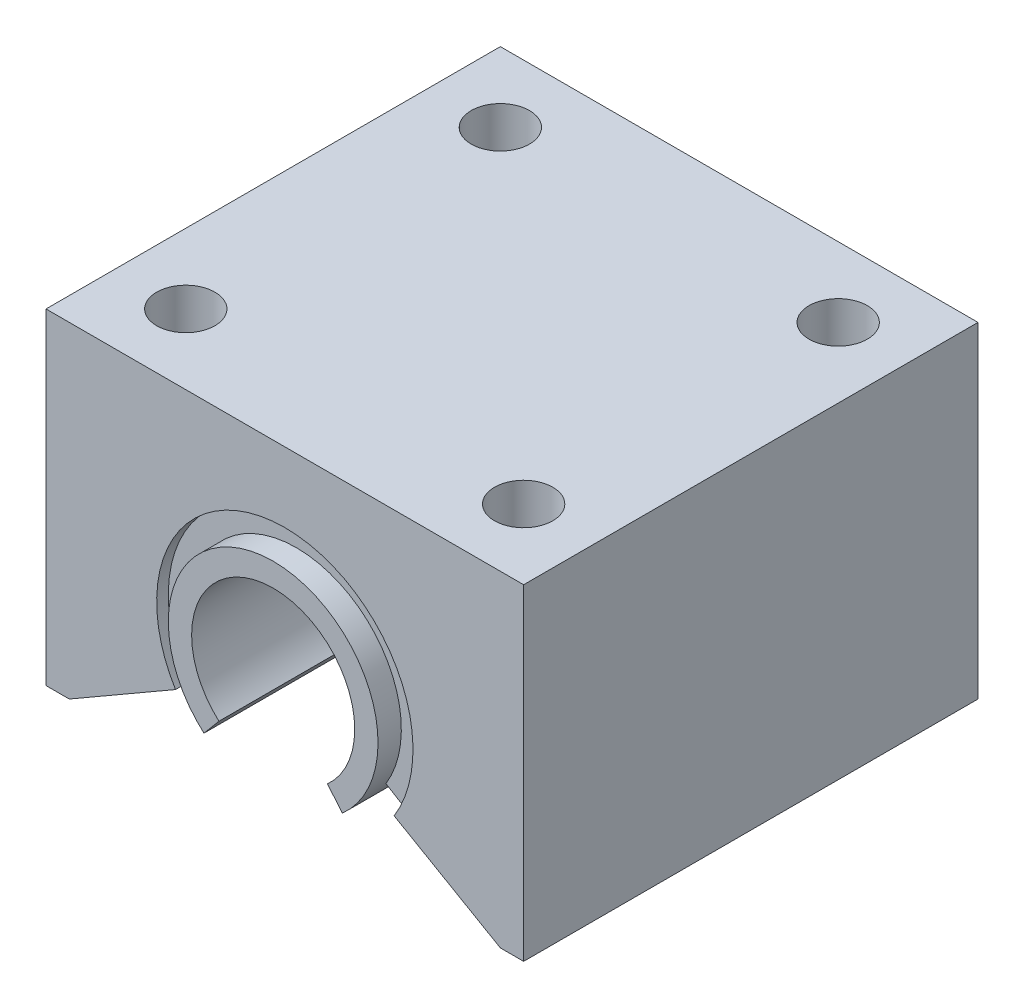
ISO-10303-21;
HEADER;
FILE_DESCRIPTION(('STEP AP214'),'2;1');
FILE_NAME('part.step','',(''),(''),'','','');
FILE_SCHEMA(('AUTOMOTIVE_DESIGN { 1 0 10303 214 1 1 1 1 }'));
ENDSEC;
DATA;
#1=APPLICATION_CONTEXT('core data for automotive mechanical design processes');
#2=APPLICATION_PROTOCOL_DEFINITION('international standard','automotive_design',2000,#1);
#3=PRODUCT_CONTEXT('',#1,'mechanical');
#4=PRODUCT('Part','Part','',(#3));
#5=PRODUCT_RELATED_PRODUCT_CATEGORY('part','',(#4));
#6=PRODUCT_DEFINITION_FORMATION('','',#4);
#7=PRODUCT_DEFINITION_CONTEXT('part definition',#1,'design');
#8=PRODUCT_DEFINITION('design','',#6,#7);
#9=PRODUCT_DEFINITION_SHAPE('','',#8);
#10=(LENGTH_UNIT() NAMED_UNIT(*) SI_UNIT(.MILLI.,.METRE.));
#11=(NAMED_UNIT(*) PLANE_ANGLE_UNIT() SI_UNIT($,.RADIAN.));
#12=(NAMED_UNIT(*) SI_UNIT($,.STERADIAN.) SOLID_ANGLE_UNIT());
#13=UNCERTAINTY_MEASURE_WITH_UNIT(LENGTH_MEASURE(1.E-05),#10,'distance_accuracy_value','');
#14=(GEOMETRIC_REPRESENTATION_CONTEXT(3) GLOBAL_UNCERTAINTY_ASSIGNED_CONTEXT((#13)) GLOBAL_UNIT_ASSIGNED_CONTEXT((#10,
#11,#12)) REPRESENTATION_CONTEXT('',''));
#15=CARTESIAN_POINT('',(0.,0.,0.));
#16=DIRECTION('',(0.,0.,1.));
#17=DIRECTION('',(1.,0.,0.));
#18=AXIS2_PLACEMENT_3D('',#15,#16,#17);
#19=CARTESIAN_POINT('',(0.,-3.,39.));
#20=DIRECTION('',(0.,0.,-1.));
#21=DIRECTION('',(-1.,0.,0.));
#22=AXIS2_PLACEMENT_3D('',#19,#20,#21);
#23=CYLINDRICAL_SURFACE('',#22,11.);
#24=CARTESIAN_POINT('',(0.,-3.,1.));
#25=DIRECTION('',(0.,0.,1.));
#26=DIRECTION('',(1.,0.,0.));
#27=AXIS2_PLACEMENT_3D('',#24,#25,#26);
#28=CIRCLE('',#27,11.);
#29=CARTESIAN_POINT('',(9.38513451930909,-8.73752996109588,1.));
#30=VERTEX_POINT('',#29);
#31=CARTESIAN_POINT('',(-9.38513451930909,-8.73752996109588,1.));
#32=VERTEX_POINT('',#31);
#33=EDGE_CURVE('E56',#30,#32,#28,.T.);
#34=ORIENTED_EDGE('',*,*,#33,.T.);
#35=DIRECTION('',(0.,0.,-1.));
#36=VECTOR('',#35,1.);
#37=CARTESIAN_POINT('',(-9.38513451930909,-8.73752996109588,39.));
#38=LINE('',#37,#36);
#39=CARTESIAN_POINT('',(-9.38513451930909,-8.73752996109588,0.));
#40=VERTEX_POINT('',#39);
#41=EDGE_CURVE('E145',#32,#40,#38,.T.);
#42=ORIENTED_EDGE('',*,*,#41,.T.);
#43=CARTESIAN_POINT('',(0.,-3.,0.));
#44=DIRECTION('',(0.,0.,-1.));
#45=DIRECTION('',(1.,0.,0.));
#46=AXIS2_PLACEMENT_3D('',#43,#44,#45);
#47=CIRCLE('',#46,11.);
#48=CARTESIAN_POINT('',(9.38513451930909,-8.73752996109588,0.));
#49=VERTEX_POINT('',#48);
#50=EDGE_CURVE('E168',#40,#49,#47,.T.);
#51=ORIENTED_EDGE('',*,*,#50,.T.);
#52=DIRECTION('',(0.,0.,-1.));
#53=VECTOR('',#52,1.);
#54=CARTESIAN_POINT('',(9.38513451930909,-8.73752996109588,39.));
#55=LINE('',#54,#53);
#56=EDGE_CURVE('E174',#30,#49,#55,.T.);
#57=ORIENTED_EDGE('',*,*,#56,.F.);
#58=EDGE_LOOP('',(#34,#42,#51,#57));
#59=FACE_BOUND('',#58,.T.);
#60=ADVANCED_FACE('F41',(#59),#23,.F.);
#61=CARTESIAN_POINT('',(18.5,-14.,39.));
#62=DIRECTION('',(0.,1.,0.));
#63=DIRECTION('',(-1.,0.,0.));
#64=AXIS2_PLACEMENT_3D('',#61,#62,#63);
#65=PLANE('',#64);
#66=DIRECTION('',(1.,0.,0.));
#67=VECTOR('',#66,1.);
#68=CARTESIAN_POINT('',(18.5,-14.,0.));
#69=LINE('',#68,#67);
#70=CARTESIAN_POINT('',(18.5,-14.,0.));
#71=VERTEX_POINT('',#70);
#72=CARTESIAN_POINT('',(20.5,-14.,0.));
#73=VERTEX_POINT('',#72);
#74=EDGE_CURVE('E155',#71,#73,#69,.T.);
#75=ORIENTED_EDGE('',*,*,#74,.T.);
#76=DIRECTION('',(0.,0.,-1.));
#77=VECTOR('',#76,1.);
#78=CARTESIAN_POINT('',(20.5,-14.,39.));
#79=LINE('',#78,#77);
#80=CARTESIAN_POINT('',(20.5,-14.,39.));
#81=VERTEX_POINT('',#80);
#82=EDGE_CURVE('E11',#81,#73,#79,.T.);
#83=ORIENTED_EDGE('',*,*,#82,.F.);
#84=DIRECTION('',(1.,0.,0.));
#85=VECTOR('',#84,1.);
#86=CARTESIAN_POINT('',(18.5,-14.,39.));
#87=LINE('',#86,#85);
#88=CARTESIAN_POINT('',(18.5,-14.,39.));
#89=VERTEX_POINT('',#88);
#90=EDGE_CURVE('E172',#89,#81,#87,.T.);
#91=ORIENTED_EDGE('',*,*,#90,.F.);
#92=DIRECTION('',(0.,0.,-1.));
#93=VECTOR('',#92,1.);
#94=CARTESIAN_POINT('',(18.5,-14.,39.));
#95=LINE('',#94,#93);
#96=EDGE_CURVE('E151',#89,#71,#95,.T.);
#97=ORIENTED_EDGE('',*,*,#96,.T.);
#98=EDGE_LOOP('',(#75,#83,#91,#97));
#99=FACE_BOUND('',#98,.T.);
#100=ADVANCED_FACE('F43',(#99),#65,.F.);
#101=CARTESIAN_POINT('',(20.5,14.,39.));
#102=DIRECTION('',(-1.,0.,0.));
#103=DIRECTION('',(0.,-1.,0.));
#104=AXIS2_PLACEMENT_3D('',#101,#102,#103);
#105=PLANE('',#104);
#106=DIRECTION('',(0.,1.,0.));
#107=VECTOR('',#106,1.);
#108=CARTESIAN_POINT('',(20.5,14.,0.));
#109=LINE('',#108,#107);
#110=CARTESIAN_POINT('',(20.5,14.,0.));
#111=VERTEX_POINT('',#110);
#112=EDGE_CURVE('E158',#73,#111,#109,.T.);
#113=ORIENTED_EDGE('',*,*,#112,.T.);
#114=DIRECTION('',(0.,0.,-1.));
#115=VECTOR('',#114,1.);
#116=CARTESIAN_POINT('',(20.5,14.,39.));
#117=LINE('',#116,#115);
#118=CARTESIAN_POINT('',(20.5,14.,39.));
#119=VERTEX_POINT('',#118);
#120=EDGE_CURVE('E49',#119,#111,#117,.T.);
#121=ORIENTED_EDGE('',*,*,#120,.F.);
#122=DIRECTION('',(0.,1.,0.));
#123=VECTOR('',#122,1.);
#124=CARTESIAN_POINT('',(20.5,14.,39.));
#125=LINE('',#124,#123);
#126=EDGE_CURVE('E105',#81,#119,#125,.T.);
#127=ORIENTED_EDGE('',*,*,#126,.F.);
#128=ORIENTED_EDGE('',*,*,#82,.T.);
#129=EDGE_LOOP('',(#113,#121,#127,#128));
#130=FACE_BOUND('',#129,.T.);
#131=ADVANCED_FACE('F353',(#130),#105,.F.);
#132=CARTESIAN_POINT('',(-20.5,14.,39.));
#133=DIRECTION('',(0.,-1.,0.));
#134=DIRECTION('',(0.,0.,-1.));
#135=AXIS2_PLACEMENT_3D('',#132,#133,#134);
#136=PLANE('',#135);
#137=CARTESIAN_POINT('',(-14.4999987013249,14.,33.));
#138=DIRECTION('',(0.,1.,0.));
#139=DIRECTION('',(0.,0.,1.));
#140=AXIS2_PLACEMENT_3D('',#137,#138,#139);
#141=CIRCLE('',#140,2.5);
#142=CARTESIAN_POINT('',(-14.4999987013249,14.,35.5));
#143=VERTEX_POINT('',#142);
#144=EDGE_CURVE('E281',#143,#143,#141,.T.);
#145=ORIENTED_EDGE('',*,*,#144,.F.);
#146=EDGE_LOOP('',(#145));
#147=FACE_BOUND('',#146,.T.);
#148=CARTESIAN_POINT('',(14.5,14.,33.));
#149=DIRECTION('',(0.,1.,0.));
#150=DIRECTION('',(0.,0.,1.));
#151=AXIS2_PLACEMENT_3D('',#148,#149,#150);
#152=CIRCLE('',#151,2.5);
#153=CARTESIAN_POINT('',(14.5,14.,35.5));
#154=VERTEX_POINT('',#153);
#155=EDGE_CURVE('E288',#154,#154,#152,.T.);
#156=ORIENTED_EDGE('',*,*,#155,.F.);
#157=EDGE_LOOP('',(#156));
#158=FACE_BOUND('',#157,.T.);
#159=CARTESIAN_POINT('',(14.4999987013249,14.,6.));
#160=DIRECTION('',(0.,1.,0.));
#161=DIRECTION('',(0.,0.,1.));
#162=AXIS2_PLACEMENT_3D('',#159,#160,#161);
#163=CIRCLE('',#162,2.5);
#164=CARTESIAN_POINT('',(14.4999987013249,14.,8.5));
#165=VERTEX_POINT('',#164);
#166=EDGE_CURVE('E294',#165,#165,#163,.T.);
#167=ORIENTED_EDGE('',*,*,#166,.F.);
#168=EDGE_LOOP('',(#167));
#169=FACE_BOUND('',#168,.T.);
#170=CARTESIAN_POINT('',(-14.5,14.,6.));
#171=DIRECTION('',(0.,1.,0.));
#172=DIRECTION('',(0.,0.,1.));
#173=AXIS2_PLACEMENT_3D('',#170,#171,#172);
#174=CIRCLE('',#173,2.5);
#175=CARTESIAN_POINT('',(-14.5,14.,8.5));
#176=VERTEX_POINT('',#175);
#177=EDGE_CURVE('E275',#176,#176,#174,.T.);
#178=ORIENTED_EDGE('',*,*,#177,.F.);
#179=EDGE_LOOP('',(#178));
#180=FACE_BOUND('',#179,.T.);
#181=DIRECTION('',(-1.,0.,0.));
#182=VECTOR('',#181,1.);
#183=CARTESIAN_POINT('',(-20.5,14.,0.));
#184=LINE('',#183,#182);
#185=CARTESIAN_POINT('',(-20.5,14.,0.));
#186=VERTEX_POINT('',#185);
#187=EDGE_CURVE('E160',#111,#186,#184,.T.);
#188=ORIENTED_EDGE('',*,*,#187,.T.);
#189=DIRECTION('',(0.,0.,-1.));
#190=VECTOR('',#189,1.);
#191=CARTESIAN_POINT('',(-20.5,14.,39.));
#192=LINE('',#191,#190);
#193=CARTESIAN_POINT('',(-20.5,14.,39.));
#194=VERTEX_POINT('',#193);
#195=EDGE_CURVE('E180',#194,#186,#192,.T.);
#196=ORIENTED_EDGE('',*,*,#195,.F.);
#197=DIRECTION('',(-1.,0.,0.));
#198=VECTOR('',#197,1.);
#199=CARTESIAN_POINT('',(-20.5,14.,39.));
#200=LINE('',#199,#198);
#201=EDGE_CURVE('E188',#119,#194,#200,.T.);
#202=ORIENTED_EDGE('',*,*,#201,.F.);
#203=ORIENTED_EDGE('',*,*,#120,.T.);
#204=EDGE_LOOP('',(#188,#196,#202,#203));
#205=FACE_BOUND('',#204,.T.);
#206=ADVANCED_FACE('F186',(#147,#158,#169,#180,#205),#136,.F.);
#207=CARTESIAN_POINT('',(-20.5,14.,39.));
#208=DIRECTION('',(1.,0.,0.));
#209=DIRECTION('',(0.,1.,0.));
#210=AXIS2_PLACEMENT_3D('',#207,#208,#209);
#211=PLANE('',#210);
#212=DIRECTION('',(0.,-1.,0.));
#213=VECTOR('',#212,1.);
#214=CARTESIAN_POINT('',(-20.5,14.,0.));
#215=LINE('',#214,#213);
#216=CARTESIAN_POINT('',(-20.5,-14.,0.));
#217=VERTEX_POINT('',#216);
#218=EDGE_CURVE('E162',#186,#217,#215,.T.);
#219=ORIENTED_EDGE('',*,*,#218,.T.);
#220=DIRECTION('',(0.,0.,-1.));
#221=VECTOR('',#220,1.);
#222=CARTESIAN_POINT('',(-20.5,-14.,39.));
#223=LINE('',#222,#221);
#224=CARTESIAN_POINT('',(-20.5,-14.,39.));
#225=VERTEX_POINT('',#224);
#226=EDGE_CURVE('E177',#225,#217,#223,.T.);
#227=ORIENTED_EDGE('',*,*,#226,.F.);
#228=DIRECTION('',(0.,-1.,0.));
#229=VECTOR('',#228,1.);
#230=CARTESIAN_POINT('',(-20.5,14.,39.));
#231=LINE('',#230,#229);
#232=EDGE_CURVE('E201',#194,#225,#231,.T.);
#233=ORIENTED_EDGE('',*,*,#232,.F.);
#234=ORIENTED_EDGE('',*,*,#195,.T.);
#235=EDGE_LOOP('',(#219,#227,#233,#234));
#236=FACE_BOUND('',#235,.T.);
#237=ADVANCED_FACE('F197',(#236),#211,.F.);
#238=CARTESIAN_POINT('',(-20.5,-14.,39.));
#239=DIRECTION('',(0.,1.,0.));
#240=DIRECTION('',(-1.,0.,0.));
#241=AXIS2_PLACEMENT_3D('',#238,#239,#240);
#242=PLANE('',#241);
#243=DIRECTION('',(1.,0.,0.));
#244=VECTOR('',#243,1.);
#245=CARTESIAN_POINT('',(-20.5,-14.,0.));
#246=LINE('',#245,#244);
#247=CARTESIAN_POINT('',(-18.5,-14.,0.));
#248=VERTEX_POINT('',#247);
#249=EDGE_CURVE('E164',#217,#248,#246,.T.);
#250=ORIENTED_EDGE('',*,*,#249,.T.);
#251=DIRECTION('',(0.,0.,-1.));
#252=VECTOR('',#251,1.);
#253=CARTESIAN_POINT('',(-18.5,-14.,39.));
#254=LINE('',#253,#252);
#255=CARTESIAN_POINT('',(-18.5,-14.,39.));
#256=VERTEX_POINT('',#255);
#257=EDGE_CURVE('E144',#256,#248,#254,.T.);
#258=ORIENTED_EDGE('',*,*,#257,.F.);
#259=DIRECTION('',(1.,0.,0.));
#260=VECTOR('',#259,1.);
#261=CARTESIAN_POINT('',(-20.5,-14.,39.));
#262=LINE('',#261,#260);
#263=EDGE_CURVE('E128',#225,#256,#262,.T.);
#264=ORIENTED_EDGE('',*,*,#263,.F.);
#265=ORIENTED_EDGE('',*,*,#226,.T.);
#266=EDGE_LOOP('',(#250,#258,#264,#265));
#267=FACE_BOUND('',#266,.T.);
#268=ADVANCED_FACE('F200',(#267),#242,.F.);
#269=CARTESIAN_POINT('',(-18.5,-14.,39.));
#270=DIRECTION('',(-0.5,0.866025403784439,0.));
#271=DIRECTION('',(-0.866025403784439,-0.5,0.));
#272=AXIS2_PLACEMENT_3D('',#269,#270,#271);
#273=PLANE('',#272);
#274=DIRECTION('',(0.866025403784439,0.5,0.));
#275=VECTOR('',#274,1.);
#276=CARTESIAN_POINT('',(-18.5,-14.,0.));
#277=LINE('',#276,#275);
#278=EDGE_CURVE('E166',#248,#40,#277,.T.);
#279=ORIENTED_EDGE('',*,*,#278,.T.);
#280=ORIENTED_EDGE('',*,*,#41,.F.);
#281=DIRECTION('',(0.,0.,-1.));
#282=VECTOR('',#281,1.);
#283=CARTESIAN_POINT('',(-9.38513451930909,-8.73752996109588,38.));
#284=LINE('',#283,#282);
#285=CARTESIAN_POINT('',(-9.38513451930909,-8.73752996109588,38.));
#286=VERTEX_POINT('',#285);
#287=EDGE_CURVE('E141',#286,#32,#284,.T.);
#288=ORIENTED_EDGE('',*,*,#287,.F.);
#289=CARTESIAN_POINT('',(-9.38513451930909,-8.73752996109588,39.));
#290=VERTEX_POINT('',#289);
#291=EDGE_CURVE('E135',#290,#286,#38,.T.);
#292=ORIENTED_EDGE('',*,*,#291,.F.);
#293=DIRECTION('',(0.866025403784439,0.5,0.));
#294=VECTOR('',#293,1.);
#295=CARTESIAN_POINT('',(-18.5,-14.,39.));
#296=LINE('',#295,#294);
#297=EDGE_CURVE('E121',#256,#290,#296,.T.);
#298=ORIENTED_EDGE('',*,*,#297,.F.);
#299=ORIENTED_EDGE('',*,*,#257,.T.);
#300=EDGE_LOOP('',(#279,#280,#288,#292,#298,#299));
#301=FACE_BOUND('',#300,.T.);
#302=ADVANCED_FACE('F137',(#301),#273,.F.);
#303=ORIENTED_EDGE('',*,*,#291,.T.);
#304=CARTESIAN_POINT('',(0.,-3.,38.));
#305=DIRECTION('',(0.,0.,1.));
#306=DIRECTION('',(1.,0.,0.));
#307=AXIS2_PLACEMENT_3D('',#304,#305,#306);
#308=CIRCLE('',#307,11.);
#309=CARTESIAN_POINT('',(9.38513451930905,-8.73752996109594,38.));
#310=VERTEX_POINT('',#309);
#311=EDGE_CURVE('E220',#310,#286,#308,.T.);
#312=ORIENTED_EDGE('',*,*,#311,.F.);
#313=CARTESIAN_POINT('',(9.38513451930909,-8.73752996109588,39.));
#314=VERTEX_POINT('',#313);
#315=EDGE_CURVE('E149',#314,#310,#55,.T.);
#316=ORIENTED_EDGE('',*,*,#315,.F.);
#317=CARTESIAN_POINT('',(0.,-3.,39.));
#318=DIRECTION('',(0.,0.,-1.));
#319=DIRECTION('',(1.,0.,0.));
#320=AXIS2_PLACEMENT_3D('',#317,#318,#319);
#321=CIRCLE('',#320,11.);
#322=EDGE_CURVE('E125',#290,#314,#321,.T.);
#323=ORIENTED_EDGE('',*,*,#322,.F.);
#324=EDGE_LOOP('',(#303,#312,#316,#323));
#325=FACE_BOUND('',#324,.T.);
#326=ADVANCED_FACE('F147',(#325),#23,.F.);
#327=CARTESIAN_POINT('',(18.5,-14.,39.));
#328=DIRECTION('',(0.500000000000001,0.866025403784438,0.));
#329=DIRECTION('',(-0.866025403784438,0.500000000000001,0.));
#330=AXIS2_PLACEMENT_3D('',#327,#328,#329);
#331=PLANE('',#330);
#332=DIRECTION('',(0.866025403784438,-0.500000000000001,0.));
#333=VECTOR('',#332,1.);
#334=CARTESIAN_POINT('',(18.5,-14.,0.));
#335=LINE('',#334,#333);
#336=EDGE_CURVE('E97',#49,#71,#335,.T.);
#337=ORIENTED_EDGE('',*,*,#336,.T.);
#338=ORIENTED_EDGE('',*,*,#96,.F.);
#339=DIRECTION('',(0.866025403784438,-0.500000000000001,0.));
#340=VECTOR('',#339,1.);
#341=CARTESIAN_POINT('',(18.5,-14.,39.));
#342=LINE('',#341,#340);
#343=EDGE_CURVE('E65',#314,#89,#342,.T.);
#344=ORIENTED_EDGE('',*,*,#343,.F.);
#345=ORIENTED_EDGE('',*,*,#315,.T.);
#346=DIRECTION('',(0.,0.,-1.));
#347=VECTOR('',#346,1.);
#348=CARTESIAN_POINT('',(9.38513451930905,-8.73752996109594,38.));
#349=LINE('',#348,#347);
#350=EDGE_CURVE('E214',#310,#30,#349,.T.);
#351=ORIENTED_EDGE('',*,*,#350,.T.);
#352=ORIENTED_EDGE('',*,*,#56,.T.);
#353=EDGE_LOOP('',(#337,#338,#344,#345,#351,#352));
#354=FACE_BOUND('',#353,.T.);
#355=ADVANCED_FACE('F392',(#354),#331,.F.);
#356=CARTESIAN_POINT('',(0.,-3.,39.));
#357=DIRECTION('',(0.,0.,1.));
#358=DIRECTION('',(1.,0.,0.));
#359=AXIS2_PLACEMENT_3D('',#356,#357,#358);
#360=PLANE('',#359);
#361=ORIENTED_EDGE('',*,*,#90,.T.);
#362=ORIENTED_EDGE('',*,*,#126,.T.);
#363=ORIENTED_EDGE('',*,*,#201,.T.);
#364=ORIENTED_EDGE('',*,*,#232,.T.);
#365=ORIENTED_EDGE('',*,*,#263,.T.);
#366=ORIENTED_EDGE('',*,*,#297,.T.);
#367=ORIENTED_EDGE('',*,*,#322,.T.);
#368=ORIENTED_EDGE('',*,*,#343,.T.);
#369=EDGE_LOOP('',(#361,#362,#363,#364,#365,#366,#367,#368));
#370=FACE_BOUND('',#369,.T.);
#371=ADVANCED_FACE('F123',(#370),#360,.T.);
#372=CARTESIAN_POINT('',(0.,-3.,0.));
#373=DIRECTION('',(0.,0.,1.));
#374=DIRECTION('',(1.,0.,0.));
#375=AXIS2_PLACEMENT_3D('',#372,#373,#374);
#376=PLANE('',#375);
#377=ORIENTED_EDGE('',*,*,#74,.F.);
#378=ORIENTED_EDGE('',*,*,#336,.F.);
#379=ORIENTED_EDGE('',*,*,#50,.F.);
#380=ORIENTED_EDGE('',*,*,#278,.F.);
#381=ORIENTED_EDGE('',*,*,#249,.F.);
#382=ORIENTED_EDGE('',*,*,#218,.F.);
#383=ORIENTED_EDGE('',*,*,#187,.F.);
#384=ORIENTED_EDGE('',*,*,#112,.F.);
#385=EDGE_LOOP('',(#377,#378,#379,#380,#381,#382,#383,#384));
#386=FACE_BOUND('',#385,.T.);
#387=ADVANCED_FACE('F192',(#386),#376,.F.);
#388=CARTESIAN_POINT('',(-9.38513451930909,-8.73752996109588,38.));
#389=DIRECTION('',(-0.521593632826898,0.853194047209918,0.));
#390=DIRECTION('',(-0.853194047209918,-0.521593632826898,0.));
#391=AXIS2_PLACEMENT_3D('',#388,#389,#390);
#392=PLANE('',#391);
#393=DIRECTION('',(0.853194047209918,0.521593632826898,0.));
#394=VECTOR('',#393,1.);
#395=CARTESIAN_POINT('',(-9.38513451930909,-8.73752996109588,1.));
#396=LINE('',#395,#394);
#397=CARTESIAN_POINT('',(-7.67874642488926,-7.69434269544209,1.));
#398=VERTEX_POINT('',#397);
#399=EDGE_CURVE('E224',#32,#398,#396,.T.);
#400=ORIENTED_EDGE('',*,*,#399,.T.);
#401=DIRECTION('',(0.,0.,-1.));
#402=VECTOR('',#401,1.);
#403=CARTESIAN_POINT('',(-7.67874642488926,-7.69434269544209,38.));
#404=LINE('',#403,#402);
#405=CARTESIAN_POINT('',(-7.67874642488926,-7.69434269544209,38.));
#406=VERTEX_POINT('',#405);
#407=EDGE_CURVE('E208',#406,#398,#404,.T.);
#408=ORIENTED_EDGE('',*,*,#407,.F.);
#409=DIRECTION('',(0.853194047209918,0.521593632826898,0.));
#410=VECTOR('',#409,1.);
#411=CARTESIAN_POINT('',(-9.38513451930909,-8.73752996109588,38.));
#412=LINE('',#411,#410);
#413=EDGE_CURVE('E234',#286,#406,#412,.T.);
#414=ORIENTED_EDGE('',*,*,#413,.F.);
#415=ORIENTED_EDGE('',*,*,#287,.T.);
#416=EDGE_LOOP('',(#400,#408,#414,#415));
#417=FACE_BOUND('',#416,.T.);
#418=ADVANCED_FACE('F697',(#417),#392,.F.);
#419=CARTESIAN_POINT('',(9.38513451930905,-8.73752996109594,38.));
#420=DIRECTION('',(0.521593632826904,0.853194047209914,0.));
#421=DIRECTION('',(-0.853194047209914,0.521593632826904,0.));
#422=AXIS2_PLACEMENT_3D('',#419,#420,#421);
#423=PLANE('',#422);
#424=DIRECTION('',(0.853194047209914,-0.521593632826904,0.));
#425=VECTOR('',#424,1.);
#426=CARTESIAN_POINT('',(9.38513451930905,-8.73752996109594,1.));
#427=LINE('',#426,#425);
#428=CARTESIAN_POINT('',(7.67874642488923,-7.69434269544213,1.));
#429=VERTEX_POINT('',#428);
#430=EDGE_CURVE('E218',#429,#30,#427,.T.);
#431=ORIENTED_EDGE('',*,*,#430,.T.);
#432=ORIENTED_EDGE('',*,*,#350,.F.);
#433=DIRECTION('',(0.853194047209914,-0.521593632826904,0.));
#434=VECTOR('',#433,1.);
#435=CARTESIAN_POINT('',(9.38513451930905,-8.73752996109594,38.));
#436=LINE('',#435,#434);
#437=CARTESIAN_POINT('',(7.67874642488922,-7.69434269544213,38.));
#438=VERTEX_POINT('',#437);
#439=EDGE_CURVE('E217',#438,#310,#436,.T.);
#440=ORIENTED_EDGE('',*,*,#439,.F.);
#441=DIRECTION('',(0.,0.,-1.));
#442=VECTOR('',#441,1.);
#443=CARTESIAN_POINT('',(7.67874642488922,-7.69434269544213,38.));
#444=LINE('',#443,#442);
#445=EDGE_CURVE('E211',#438,#429,#444,.T.);
#446=ORIENTED_EDGE('',*,*,#445,.T.);
#447=EDGE_LOOP('',(#431,#432,#440,#446));
#448=FACE_BOUND('',#447,.T.);
#449=ADVANCED_FACE('F689',(#448),#423,.F.);
#450=CARTESIAN_POINT('',(0.,-3.,38.));
#451=DIRECTION('',(0.,0.,1.));
#452=DIRECTION('',(1.,0.,0.));
#453=AXIS2_PLACEMENT_3D('',#450,#451,#452);
#454=PLANE('',#453);
#455=ORIENTED_EDGE('',*,*,#311,.T.);
#456=ORIENTED_EDGE('',*,*,#413,.T.);
#457=CARTESIAN_POINT('',(0.,-3.,38.));
#458=DIRECTION('',(0.,0.,-1.));
#459=DIRECTION('',(1.,0.,0.));
#460=AXIS2_PLACEMENT_3D('',#457,#458,#459);
#461=CIRCLE('',#460,9.);
#462=EDGE_CURVE('E231',#406,#438,#461,.T.);
#463=ORIENTED_EDGE('',*,*,#462,.T.);
#464=ORIENTED_EDGE('',*,*,#439,.T.);
#465=EDGE_LOOP('',(#455,#456,#463,#464));
#466=FACE_BOUND('',#465,.T.);
#467=ADVANCED_FACE('F682',(#466),#454,.T.);
#468=CARTESIAN_POINT('',(0.,-3.,1.));
#469=DIRECTION('',(0.,0.,1.));
#470=DIRECTION('',(1.,0.,0.));
#471=AXIS2_PLACEMENT_3D('',#468,#469,#470);
#472=PLANE('',#471);
#473=ORIENTED_EDGE('',*,*,#33,.F.);
#474=ORIENTED_EDGE('',*,*,#430,.F.);
#475=CARTESIAN_POINT('',(0.,-3.,1.));
#476=DIRECTION('',(0.,0.,-1.));
#477=DIRECTION('',(1.,0.,0.));
#478=AXIS2_PLACEMENT_3D('',#475,#476,#477);
#479=CIRCLE('',#478,9.);
#480=EDGE_CURVE('E221',#398,#429,#479,.T.);
#481=ORIENTED_EDGE('',*,*,#480,.F.);
#482=ORIENTED_EDGE('',*,*,#399,.F.);
#483=EDGE_LOOP('',(#473,#474,#481,#482));
#484=FACE_BOUND('',#483,.T.);
#485=ADVANCED_FACE('F674',(#484),#472,.F.);
#486=CARTESIAN_POINT('',(0.,-3.,40.));
#487=DIRECTION('',(0.,0.,-1.));
#488=DIRECTION('',(-1.,0.,0.));
#489=AXIS2_PLACEMENT_3D('',#486,#487,#488);
#490=CYLINDRICAL_SURFACE('',#489,9.);
#491=ORIENTED_EDGE('',*,*,#462,.F.);
#492=ORIENTED_EDGE('',*,*,#407,.T.);
#493=ORIENTED_EDGE('',*,*,#480,.T.);
#494=ORIENTED_EDGE('',*,*,#445,.F.);
#495=EDGE_LOOP('',(#491,#492,#493,#494));
#496=FACE_BOUND('',#495,.T.);
#497=CARTESIAN_POINT('',(0.,-3.,-1.));
#498=DIRECTION('',(0.,0.,1.));
#499=DIRECTION('',(1.,0.,0.));
#500=AXIS2_PLACEMENT_3D('',#497,#498,#499);
#501=CIRCLE('',#500,9.);
#502=CARTESIAN_POINT('',(5.94194790038679,-9.75967862764858,-1.));
#503=VERTEX_POINT('',#502);
#504=CARTESIAN_POINT('',(-5.94194790038679,-9.75967862764858,-1.));
#505=VERTEX_POINT('',#504);
#506=EDGE_CURVE('E261',#503,#505,#501,.T.);
#507=ORIENTED_EDGE('',*,*,#506,.T.);
#508=DIRECTION('',(0.,0.,-1.));
#509=VECTOR('',#508,1.);
#510=CARTESIAN_POINT('',(-5.94194790038679,-9.75967862764858,40.));
#511=LINE('',#510,#509);
#512=CARTESIAN_POINT('',(-5.94194790038679,-9.75967862764858,40.));
#513=VERTEX_POINT('',#512);
#514=EDGE_CURVE('E228',#513,#505,#511,.T.);
#515=ORIENTED_EDGE('',*,*,#514,.F.);
#516=CARTESIAN_POINT('',(0.,-3.,40.));
#517=DIRECTION('',(0.,0.,1.));
#518=DIRECTION('',(1.,0.,0.));
#519=AXIS2_PLACEMENT_3D('',#516,#517,#518);
#520=CIRCLE('',#519,9.);
#521=CARTESIAN_POINT('',(5.94194790038679,-9.75967862764858,40.));
#522=VERTEX_POINT('',#521);
#523=EDGE_CURVE('E254',#522,#513,#520,.T.);
#524=ORIENTED_EDGE('',*,*,#523,.F.);
#525=DIRECTION('',(0.,0.,-1.));
#526=VECTOR('',#525,1.);
#527=CARTESIAN_POINT('',(5.94194790038679,-9.75967862764858,40.));
#528=LINE('',#527,#526);
#529=EDGE_CURVE('E247',#522,#503,#528,.T.);
#530=ORIENTED_EDGE('',*,*,#529,.T.);
#531=EDGE_LOOP('',(#507,#515,#524,#530));
#532=FACE_BOUND('',#531,.T.);
#533=ADVANCED_FACE('F666',(#496,#532),#490,.T.);
#534=CARTESIAN_POINT('',(-5.94194790038679,-9.75967862764858,40.));
#535=DIRECTION('',(-0.766044443118979,0.642787609686538,0.));
#536=DIRECTION('',(-0.642787609686538,-0.766044443118979,0.));
#537=AXIS2_PLACEMENT_3D('',#534,#535,#536);
#538=PLANE('',#537);
#539=DIRECTION('',(0.642787609686538,0.766044443118979,0.));
#540=VECTOR('',#539,1.);
#541=CARTESIAN_POINT('',(-5.94194790038679,-9.75967862764858,-1.));
#542=LINE('',#541,#540);
#543=CARTESIAN_POINT('',(-4.65593628630316,-8.22706966644654,-1.));
#544=VERTEX_POINT('',#543);
#545=EDGE_CURVE('E258',#505,#544,#542,.T.);
#546=ORIENTED_EDGE('',*,*,#545,.T.);
#547=DIRECTION('',(0.,0.,-1.));
#548=VECTOR('',#547,1.);
#549=CARTESIAN_POINT('',(-4.65593628630316,-8.22706966644654,40.));
#550=LINE('',#549,#548);
#551=CARTESIAN_POINT('',(-4.65593628630316,-8.22706966644654,40.));
#552=VERTEX_POINT('',#551);
#553=EDGE_CURVE('E241',#552,#544,#550,.T.);
#554=ORIENTED_EDGE('',*,*,#553,.F.);
#555=DIRECTION('',(0.642787609686538,0.766044443118979,0.));
#556=VECTOR('',#555,1.);
#557=CARTESIAN_POINT('',(-5.94194790038679,-9.75967862764858,40.));
#558=LINE('',#557,#556);
#559=EDGE_CURVE('E270',#513,#552,#558,.T.);
#560=ORIENTED_EDGE('',*,*,#559,.F.);
#561=ORIENTED_EDGE('',*,*,#514,.T.);
#562=EDGE_LOOP('',(#546,#554,#560,#561));
#563=FACE_BOUND('',#562,.T.);
#564=ADVANCED_FACE('F658',(#563),#538,.F.);
#565=CARTESIAN_POINT('',(0.,-3.,40.));
#566=DIRECTION('',(0.,0.,-1.));
#567=DIRECTION('',(-1.,0.,0.));
#568=AXIS2_PLACEMENT_3D('',#565,#566,#567);
#569=CYLINDRICAL_SURFACE('',#568,7.);
#570=CARTESIAN_POINT('',(0.,-3.,-1.));
#571=DIRECTION('',(0.,0.,-1.));
#572=DIRECTION('',(1.,0.,0.));
#573=AXIS2_PLACEMENT_3D('',#570,#571,#572);
#574=CIRCLE('',#573,7.);
#575=CARTESIAN_POINT('',(4.65593628630316,-8.22706966644653,-1.));
#576=VERTEX_POINT('',#575);
#577=EDGE_CURVE('E255',#544,#576,#574,.T.);
#578=ORIENTED_EDGE('',*,*,#577,.T.);
#579=DIRECTION('',(0.,0.,-1.));
#580=VECTOR('',#579,1.);
#581=CARTESIAN_POINT('',(4.65593628630316,-8.22706966644653,40.));
#582=LINE('',#581,#580);
#583=CARTESIAN_POINT('',(4.65593628630316,-8.22706966644653,40.));
#584=VERTEX_POINT('',#583);
#585=EDGE_CURVE('E244',#584,#576,#582,.T.);
#586=ORIENTED_EDGE('',*,*,#585,.F.);
#587=CARTESIAN_POINT('',(0.,-3.,40.));
#588=DIRECTION('',(0.,0.,-1.));
#589=DIRECTION('',(1.,0.,0.));
#590=AXIS2_PLACEMENT_3D('',#587,#588,#589);
#591=CIRCLE('',#590,7.);
#592=EDGE_CURVE('E267',#552,#584,#591,.T.);
#593=ORIENTED_EDGE('',*,*,#592,.F.);
#594=ORIENTED_EDGE('',*,*,#553,.T.);
#595=EDGE_LOOP('',(#578,#586,#593,#594));
#596=FACE_BOUND('',#595,.T.);
#597=ADVANCED_FACE('F650',(#596),#569,.F.);
#598=CARTESIAN_POINT('',(5.94194790038679,-9.75967862764858,40.));
#599=DIRECTION('',(0.766044443118979,0.642787609686538,0.));
#600=DIRECTION('',(-0.642787609686538,0.766044443118979,0.));
#601=AXIS2_PLACEMENT_3D('',#598,#599,#600);
#602=PLANE('',#601);
#603=DIRECTION('',(0.642787609686538,-0.766044443118979,0.));
#604=VECTOR('',#603,1.);
#605=CARTESIAN_POINT('',(5.94194790038679,-9.75967862764858,-1.));
#606=LINE('',#605,#604);
#607=EDGE_CURVE('E251',#576,#503,#606,.T.);
#608=ORIENTED_EDGE('',*,*,#607,.T.);
#609=ORIENTED_EDGE('',*,*,#529,.F.);
#610=DIRECTION('',(0.642787609686538,-0.766044443118979,0.));
#611=VECTOR('',#610,1.);
#612=CARTESIAN_POINT('',(5.94194790038679,-9.75967862764858,40.));
#613=LINE('',#612,#611);
#614=EDGE_CURVE('E250',#584,#522,#613,.T.);
#615=ORIENTED_EDGE('',*,*,#614,.F.);
#616=ORIENTED_EDGE('',*,*,#585,.T.);
#617=EDGE_LOOP('',(#608,#609,#615,#616));
#618=FACE_BOUND('',#617,.T.);
#619=ADVANCED_FACE('F643',(#618),#602,.F.);
#620=CARTESIAN_POINT('',(0.,-3.,40.));
#621=DIRECTION('',(0.,0.,1.));
#622=DIRECTION('',(1.,0.,0.));
#623=AXIS2_PLACEMENT_3D('',#620,#621,#622);
#624=PLANE('',#623);
#625=ORIENTED_EDGE('',*,*,#523,.T.);
#626=ORIENTED_EDGE('',*,*,#559,.T.);
#627=ORIENTED_EDGE('',*,*,#592,.T.);
#628=ORIENTED_EDGE('',*,*,#614,.T.);
#629=EDGE_LOOP('',(#625,#626,#627,#628));
#630=FACE_BOUND('',#629,.T.);
#631=ADVANCED_FACE('F375',(#630),#624,.T.);
#632=CARTESIAN_POINT('',(0.,-3.,-1.));
#633=DIRECTION('',(0.,0.,1.));
#634=DIRECTION('',(1.,0.,0.));
#635=AXIS2_PLACEMENT_3D('',#632,#633,#634);
#636=PLANE('',#635);
#637=ORIENTED_EDGE('',*,*,#506,.F.);
#638=ORIENTED_EDGE('',*,*,#607,.F.);
#639=ORIENTED_EDGE('',*,*,#577,.F.);
#640=ORIENTED_EDGE('',*,*,#545,.F.);
#641=EDGE_LOOP('',(#637,#638,#639,#640));
#642=FACE_BOUND('',#641,.T.);
#643=ADVANCED_FACE('F364',(#642),#636,.F.);
#644=CARTESIAN_POINT('',(-14.5,4.00000000000001,6.));
#645=DIRECTION('',(0.,1.,0.));
#646=DIRECTION('',(0.,0.,1.));
#647=AXIS2_PLACEMENT_3D('',#644,#645,#646);
#648=CYLINDRICAL_SURFACE('',#647,2.5);
#649=CARTESIAN_POINT('',(-14.5,4.00000000000001,6.));
#650=DIRECTION('',(0.,1.,0.));
#651=DIRECTION('',(0.,0.,1.));
#652=AXIS2_PLACEMENT_3D('',#649,#650,#651);
#653=CIRCLE('',#652,2.5);
#654=CARTESIAN_POINT('',(-14.5,4.00000000000001,8.5));
#655=VERTEX_POINT('',#654);
#656=EDGE_CURVE('E264',#655,#655,#653,.T.);
#657=ORIENTED_EDGE('',*,*,#656,.F.);
#658=EDGE_LOOP('',(#657));
#659=FACE_BOUND('',#658,.T.);
#660=ORIENTED_EDGE('',*,*,#177,.T.);
#661=EDGE_LOOP('',(#660));
#662=FACE_BOUND('',#661,.T.);
#663=ADVANCED_FACE('F361',(#659,#662),#648,.F.);
#664=CARTESIAN_POINT('',(-14.5,4.00000000000001,6.));
#665=DIRECTION('',(0.,1.,0.));
#666=DIRECTION('',(0.,0.,1.));
#667=AXIS2_PLACEMENT_3D('',#664,#665,#666);
#668=PLANE('',#667);
#669=CARTESIAN_POINT('',(-14.5,4.00000000000001,6.));
#670=DIRECTION('',(0.,1.,0.));
#671=DIRECTION('',(0.,0.,1.));
#672=AXIS2_PLACEMENT_3D('',#669,#670,#671);
#673=CIRCLE('',#672,2.125);
#674=CARTESIAN_POINT('',(-14.5,4.00000000000001,8.125));
#675=VERTEX_POINT('',#674);
#676=EDGE_CURVE('E322',#675,#675,#673,.T.);
#677=ORIENTED_EDGE('',*,*,#676,.F.);
#678=EDGE_LOOP('',(#677));
#679=FACE_BOUND('',#678,.T.);
#680=ORIENTED_EDGE('',*,*,#656,.T.);
#681=EDGE_LOOP('',(#680));
#682=FACE_BOUND('',#681,.T.);
#683=ADVANCED_FACE('F363',(#679,#682),#668,.T.);
#684=CARTESIAN_POINT('',(14.4999987013249,4.00000000000001,6.));
#685=DIRECTION('',(0.,1.,0.));
#686=DIRECTION('',(0.,0.,1.));
#687=AXIS2_PLACEMENT_3D('',#684,#685,#686);
#688=CYLINDRICAL_SURFACE('',#687,2.5);
#689=CARTESIAN_POINT('',(14.4999987013249,4.00000000000001,6.));
#690=DIRECTION('',(0.,1.,0.));
#691=DIRECTION('',(0.,0.,1.));
#692=AXIS2_PLACEMENT_3D('',#689,#690,#691);
#693=CIRCLE('',#692,2.5);
#694=CARTESIAN_POINT('',(14.4999987013249,4.00000000000001,8.5));
#695=VERTEX_POINT('',#694);
#696=EDGE_CURVE('E278',#695,#695,#693,.T.);
#697=ORIENTED_EDGE('',*,*,#696,.F.);
#698=EDGE_LOOP('',(#697));
#699=FACE_BOUND('',#698,.T.);
#700=ORIENTED_EDGE('',*,*,#166,.T.);
#701=EDGE_LOOP('',(#700));
#702=FACE_BOUND('',#701,.T.);
#703=ADVANCED_FACE('F371',(#699,#702),#688,.F.);
#704=CARTESIAN_POINT('',(14.4999987013249,4.00000000000001,6.));
#705=DIRECTION('',(0.,1.,0.));
#706=DIRECTION('',(0.,0.,1.));
#707=AXIS2_PLACEMENT_3D('',#704,#705,#706);
#708=PLANE('',#707);
#709=CARTESIAN_POINT('',(14.4999987013249,4.00000000000001,6.));
#710=DIRECTION('',(0.,1.,0.));
#711=DIRECTION('',(0.,0.,1.));
#712=AXIS2_PLACEMENT_3D('',#709,#710,#711);
#713=CIRCLE('',#712,2.125);
#714=CARTESIAN_POINT('',(14.4999987013249,4.00000000000001,8.125));
#715=VERTEX_POINT('',#714);
#716=EDGE_CURVE('E313',#715,#715,#713,.T.);
#717=ORIENTED_EDGE('',*,*,#716,.F.);
#718=EDGE_LOOP('',(#717));
#719=FACE_BOUND('',#718,.T.);
#720=ORIENTED_EDGE('',*,*,#696,.T.);
#721=EDGE_LOOP('',(#720));
#722=FACE_BOUND('',#721,.T.);
#723=ADVANCED_FACE('F503',(#719,#722),#708,.T.);
#724=CARTESIAN_POINT('',(14.5,4.00000000000001,33.));
#725=DIRECTION('',(0.,1.,0.));
#726=DIRECTION('',(0.,0.,1.));
#727=AXIS2_PLACEMENT_3D('',#724,#725,#726);
#728=CYLINDRICAL_SURFACE('',#727,2.5);
#729=CARTESIAN_POINT('',(14.5,4.00000000000001,33.));
#730=DIRECTION('',(0.,1.,0.));
#731=DIRECTION('',(0.,0.,1.));
#732=AXIS2_PLACEMENT_3D('',#729,#730,#731);
#733=CIRCLE('',#732,2.5);
#734=CARTESIAN_POINT('',(14.5,4.00000000000001,35.5));
#735=VERTEX_POINT('',#734);
#736=EDGE_CURVE('E291',#735,#735,#733,.T.);
#737=ORIENTED_EDGE('',*,*,#736,.F.);
#738=EDGE_LOOP('',(#737));
#739=FACE_BOUND('',#738,.T.);
#740=ORIENTED_EDGE('',*,*,#155,.T.);
#741=EDGE_LOOP('',(#740));
#742=FACE_BOUND('',#741,.T.);
#743=ADVANCED_FACE('F506',(#739,#742),#728,.F.);
#744=CARTESIAN_POINT('',(14.5,4.00000000000001,33.));
#745=DIRECTION('',(0.,1.,0.));
#746=DIRECTION('',(0.,0.,1.));
#747=AXIS2_PLACEMENT_3D('',#744,#745,#746);
#748=PLANE('',#747);
#749=CARTESIAN_POINT('',(14.5,4.00000000000001,33.));
#750=DIRECTION('',(0.,1.,0.));
#751=DIRECTION('',(0.,0.,1.));
#752=AXIS2_PLACEMENT_3D('',#749,#750,#751);
#753=CIRCLE('',#752,2.125);
#754=CARTESIAN_POINT('',(14.5,4.00000000000001,35.125));
#755=VERTEX_POINT('',#754);
#756=EDGE_CURVE('E304',#755,#755,#753,.T.);
#757=ORIENTED_EDGE('',*,*,#756,.F.);
#758=EDGE_LOOP('',(#757));
#759=FACE_BOUND('',#758,.T.);
#760=ORIENTED_EDGE('',*,*,#736,.T.);
#761=EDGE_LOOP('',(#760));
#762=FACE_BOUND('',#761,.T.);
#763=ADVANCED_FACE('F347',(#759,#762),#748,.T.);
#764=CARTESIAN_POINT('',(-14.4999987013249,4.00000000000001,33.));
#765=DIRECTION('',(0.,1.,0.));
#766=DIRECTION('',(0.,0.,1.));
#767=AXIS2_PLACEMENT_3D('',#764,#765,#766);
#768=CYLINDRICAL_SURFACE('',#767,2.5);
#769=CARTESIAN_POINT('',(-14.4999987013249,4.00000000000001,33.));
#770=DIRECTION('',(0.,1.,0.));
#771=DIRECTION('',(0.,0.,1.));
#772=AXIS2_PLACEMENT_3D('',#769,#770,#771);
#773=CIRCLE('',#772,2.5);
#774=CARTESIAN_POINT('',(-14.4999987013249,4.00000000000001,35.5));
#775=VERTEX_POINT('',#774);
#776=EDGE_CURVE('E284',#775,#775,#773,.T.);
#777=ORIENTED_EDGE('',*,*,#776,.F.);
#778=EDGE_LOOP('',(#777));
#779=FACE_BOUND('',#778,.T.);
#780=ORIENTED_EDGE('',*,*,#144,.T.);
#781=EDGE_LOOP('',(#780));
#782=FACE_BOUND('',#781,.T.);
#783=ADVANCED_FACE('F341',(#779,#782),#768,.F.);
#784=CARTESIAN_POINT('',(-14.4999987013249,4.00000000000001,33.));
#785=DIRECTION('',(0.,1.,0.));
#786=DIRECTION('',(0.,0.,1.));
#787=AXIS2_PLACEMENT_3D('',#784,#785,#786);
#788=PLANE('',#787);
#789=CARTESIAN_POINT('',(-14.4999987013249,4.00000000000001,33.));
#790=DIRECTION('',(0.,1.,0.));
#791=DIRECTION('',(0.,0.,1.));
#792=AXIS2_PLACEMENT_3D('',#789,#790,#791);
#793=CIRCLE('',#792,2.125);
#794=CARTESIAN_POINT('',(-14.4999987013249,4.00000000000001,35.125));
#795=VERTEX_POINT('',#794);
#796=EDGE_CURVE('E331',#795,#795,#793,.T.);
#797=ORIENTED_EDGE('',*,*,#796,.F.);
#798=EDGE_LOOP('',(#797));
#799=FACE_BOUND('',#798,.T.);
#800=ORIENTED_EDGE('',*,*,#776,.T.);
#801=EDGE_LOOP('',(#800));
#802=FACE_BOUND('',#801,.T.);
#803=ADVANCED_FACE('F337',(#799,#802),#788,.T.);
#804=CARTESIAN_POINT('',(14.5,3.95000000000001,33.));
#805=DIRECTION('',(0.,1.,0.));
#806=DIRECTION('',(0.,0.,1.));
#807=AXIS2_PLACEMENT_3D('',#804,#805,#806);
#808=CONICAL_SURFACE('',#807,2.1,1.02974425867665);
#809=CARTESIAN_POINT('',(14.5,2.68819270004213,33.));
#810=VERTEX_POINT('',#809);
#811=VERTEX_LOOP('',#810);
#812=FACE_BOUND('',#811,.T.);
#813=CARTESIAN_POINT('',(14.5,3.95000000000001,33.));
#814=DIRECTION('',(0.,1.,0.));
#815=DIRECTION('',(0.,0.,1.));
#816=AXIS2_PLACEMENT_3D('',#813,#814,#815);
#817=CIRCLE('',#816,2.1);
#818=CARTESIAN_POINT('',(14.5,3.95000000000001,35.1));
#819=VERTEX_POINT('',#818);
#820=EDGE_CURVE('E285',#819,#819,#817,.T.);
#821=ORIENTED_EDGE('',*,*,#820,.T.);
#822=EDGE_LOOP('',(#821));
#823=FACE_BOUND('',#822,.T.);
#824=ADVANCED_FACE('F340',(#812,#823),#808,.F.);
#825=CARTESIAN_POINT('',(14.5,4.00000000000001,33.));
#826=DIRECTION('',(0.,1.,0.));
#827=DIRECTION('',(0.,0.,1.));
#828=AXIS2_PLACEMENT_3D('',#825,#826,#827);
#829=CYLINDRICAL_SURFACE('',#828,2.1);
#830=ORIENTED_EDGE('',*,*,#820,.F.);
#831=EDGE_LOOP('',(#830));
#832=FACE_BOUND('',#831,.T.);
#833=CARTESIAN_POINT('',(14.5,3.97500000000001,33.));
#834=DIRECTION('',(0.,1.,0.));
#835=DIRECTION('',(0.,0.,1.));
#836=AXIS2_PLACEMENT_3D('',#833,#834,#835);
#837=CIRCLE('',#836,2.1);
#838=CARTESIAN_POINT('',(14.5,3.97500000000001,35.1));
#839=VERTEX_POINT('',#838);
#840=EDGE_CURVE('E301',#839,#839,#837,.T.);
#841=ORIENTED_EDGE('',*,*,#840,.T.);
#842=EDGE_LOOP('',(#841));
#843=FACE_BOUND('',#842,.T.);
#844=ADVANCED_FACE('F495',(#832,#843),#829,.F.);
#845=CARTESIAN_POINT('',(14.5,4.00000000000001,33.));
#846=DIRECTION('',(0.,1.,0.));
#847=DIRECTION('',(0.,0.,1.));
#848=AXIS2_PLACEMENT_3D('',#845,#846,#847);
#849=CONICAL_SURFACE('',#848,2.125,0.7853981633975);
#850=ORIENTED_EDGE('',*,*,#840,.F.);
#851=EDGE_LOOP('',(#850));
#852=FACE_BOUND('',#851,.T.);
#853=ORIENTED_EDGE('',*,*,#756,.T.);
#854=EDGE_LOOP('',(#853));
#855=FACE_BOUND('',#854,.T.);
#856=ADVANCED_FACE('F491',(#852,#855),#849,.F.);
#857=CARTESIAN_POINT('',(14.4999987013249,3.95000000000001,6.));
#858=DIRECTION('',(0.,1.,0.));
#859=DIRECTION('',(0.,0.,1.));
#860=AXIS2_PLACEMENT_3D('',#857,#858,#859);
#861=CONICAL_SURFACE('',#860,2.1,1.02974425867665);
#862=CARTESIAN_POINT('',(14.4999987013249,2.68819270004213,6.));
#863=VERTEX_POINT('',#862);
#864=VERTEX_LOOP('',#863);
#865=FACE_BOUND('',#864,.T.);
#866=CARTESIAN_POINT('',(14.4999987013249,3.95000000000001,6.));
#867=DIRECTION('',(0.,1.,0.));
#868=DIRECTION('',(0.,0.,1.));
#869=AXIS2_PLACEMENT_3D('',#866,#867,#868);
#870=CIRCLE('',#869,2.1);
#871=CARTESIAN_POINT('',(14.4999987013249,3.95000000000001,8.1));
#872=VERTEX_POINT('',#871);
#873=EDGE_CURVE('E307',#872,#872,#870,.T.);
#874=ORIENTED_EDGE('',*,*,#873,.T.);
#875=EDGE_LOOP('',(#874));
#876=FACE_BOUND('',#875,.T.);
#877=ADVANCED_FACE('F487',(#865,#876),#861,.F.);
#878=CARTESIAN_POINT('',(14.4999987013249,4.00000000000001,6.));
#879=DIRECTION('',(0.,1.,0.));
#880=DIRECTION('',(0.,0.,1.));
#881=AXIS2_PLACEMENT_3D('',#878,#879,#880);
#882=CYLINDRICAL_SURFACE('',#881,2.1);
#883=ORIENTED_EDGE('',*,*,#873,.F.);
#884=EDGE_LOOP('',(#883));
#885=FACE_BOUND('',#884,.T.);
#886=CARTESIAN_POINT('',(14.4999987013249,3.97500000000001,6.));
#887=DIRECTION('',(0.,1.,0.));
#888=DIRECTION('',(0.,0.,1.));
#889=AXIS2_PLACEMENT_3D('',#886,#887,#888);
#890=CIRCLE('',#889,2.1);
#891=CARTESIAN_POINT('',(14.4999987013249,3.97500000000001,8.1));
#892=VERTEX_POINT('',#891);
#893=EDGE_CURVE('E310',#892,#892,#890,.T.);
#894=ORIENTED_EDGE('',*,*,#893,.T.);
#895=EDGE_LOOP('',(#894));
#896=FACE_BOUND('',#895,.T.);
#897=ADVANCED_FACE('F483',(#885,#896),#882,.F.);
#898=CARTESIAN_POINT('',(14.4999987013249,4.00000000000001,6.));
#899=DIRECTION('',(0.,1.,0.));
#900=DIRECTION('',(0.,0.,1.));
#901=AXIS2_PLACEMENT_3D('',#898,#899,#900);
#902=CONICAL_SURFACE('',#901,2.125,0.7853981633975);
#903=ORIENTED_EDGE('',*,*,#893,.F.);
#904=EDGE_LOOP('',(#903));
#905=FACE_BOUND('',#904,.T.);
#906=ORIENTED_EDGE('',*,*,#716,.T.);
#907=EDGE_LOOP('',(#906));
#908=FACE_BOUND('',#907,.T.);
#909=ADVANCED_FACE('F479',(#905,#908),#902,.F.);
#910=CARTESIAN_POINT('',(-14.5,3.95000000000001,6.));
#911=DIRECTION('',(0.,1.,0.));
#912=DIRECTION('',(0.,0.,1.));
#913=AXIS2_PLACEMENT_3D('',#910,#911,#912);
#914=CONICAL_SURFACE('',#913,2.1,1.02974425867665);
#915=CARTESIAN_POINT('',(-14.5,2.68819270004213,6.));
#916=VERTEX_POINT('',#915);
#917=VERTEX_LOOP('',#916);
#918=FACE_BOUND('',#917,.T.);
#919=CARTESIAN_POINT('',(-14.5,3.95000000000001,6.));
#920=DIRECTION('',(0.,1.,0.));
#921=DIRECTION('',(0.,0.,1.));
#922=AXIS2_PLACEMENT_3D('',#919,#920,#921);
#923=CIRCLE('',#922,2.1);
#924=CARTESIAN_POINT('',(-14.5,3.95000000000001,8.1));
#925=VERTEX_POINT('',#924);
#926=EDGE_CURVE('E316',#925,#925,#923,.T.);
#927=ORIENTED_EDGE('',*,*,#926,.T.);
#928=EDGE_LOOP('',(#927));
#929=FACE_BOUND('',#928,.T.);
#930=ADVANCED_FACE('F475',(#918,#929),#914,.F.);
#931=CARTESIAN_POINT('',(-14.5,4.00000000000001,6.));
#932=DIRECTION('',(0.,1.,0.));
#933=DIRECTION('',(0.,0.,1.));
#934=AXIS2_PLACEMENT_3D('',#931,#932,#933);
#935=CYLINDRICAL_SURFACE('',#934,2.1);
#936=ORIENTED_EDGE('',*,*,#926,.F.);
#937=EDGE_LOOP('',(#936));
#938=FACE_BOUND('',#937,.T.);
#939=CARTESIAN_POINT('',(-14.5,3.97500000000001,6.));
#940=DIRECTION('',(0.,1.,0.));
#941=DIRECTION('',(0.,0.,1.));
#942=AXIS2_PLACEMENT_3D('',#939,#940,#941);
#943=CIRCLE('',#942,2.1);
#944=CARTESIAN_POINT('',(-14.5,3.97500000000001,8.1));
#945=VERTEX_POINT('',#944);
#946=EDGE_CURVE('E319',#945,#945,#943,.T.);
#947=ORIENTED_EDGE('',*,*,#946,.T.);
#948=EDGE_LOOP('',(#947));
#949=FACE_BOUND('',#948,.T.);
#950=ADVANCED_FACE('F471',(#938,#949),#935,.F.);
#951=CARTESIAN_POINT('',(-14.5,4.00000000000001,6.));
#952=DIRECTION('',(0.,1.,0.));
#953=DIRECTION('',(0.,0.,1.));
#954=AXIS2_PLACEMENT_3D('',#951,#952,#953);
#955=CONICAL_SURFACE('',#954,2.125,0.7853981633975);
#956=ORIENTED_EDGE('',*,*,#946,.F.);
#957=EDGE_LOOP('',(#956));
#958=FACE_BOUND('',#957,.T.);
#959=ORIENTED_EDGE('',*,*,#676,.T.);
#960=EDGE_LOOP('',(#959));
#961=FACE_BOUND('',#960,.T.);
#962=ADVANCED_FACE('F455',(#958,#961),#955,.F.);
#963=CARTESIAN_POINT('',(-14.4999987013249,3.95000000000001,33.));
#964=DIRECTION('',(0.,1.,0.));
#965=DIRECTION('',(0.,0.,1.));
#966=AXIS2_PLACEMENT_3D('',#963,#964,#965);
#967=CONICAL_SURFACE('',#966,2.1,1.02974425867665);
#968=CARTESIAN_POINT('',(-14.4999987013249,2.68819270004213,33.));
#969=VERTEX_POINT('',#968);
#970=VERTEX_LOOP('',#969);
#971=FACE_BOUND('',#970,.T.);
#972=CARTESIAN_POINT('',(-14.4999987013249,3.95000000000001,33.));
#973=DIRECTION('',(0.,1.,0.));
#974=DIRECTION('',(0.,0.,1.));
#975=AXIS2_PLACEMENT_3D('',#972,#973,#974);
#976=CIRCLE('',#975,2.1);
#977=CARTESIAN_POINT('',(-14.4999987013249,3.95000000000001,35.1));
#978=VERTEX_POINT('',#977);
#979=EDGE_CURVE('E325',#978,#978,#976,.T.);
#980=ORIENTED_EDGE('',*,*,#979,.T.);
#981=EDGE_LOOP('',(#980));
#982=FACE_BOUND('',#981,.T.);
#983=ADVANCED_FACE('F451',(#971,#982),#967,.F.);
#984=CARTESIAN_POINT('',(-14.4999987013249,4.00000000000001,33.));
#985=DIRECTION('',(0.,1.,0.));
#986=DIRECTION('',(0.,0.,1.));
#987=AXIS2_PLACEMENT_3D('',#984,#985,#986);
#988=CYLINDRICAL_SURFACE('',#987,2.1);
#989=ORIENTED_EDGE('',*,*,#979,.F.);
#990=EDGE_LOOP('',(#989));
#991=FACE_BOUND('',#990,.T.);
#992=CARTESIAN_POINT('',(-14.4999987013249,3.97500000000001,33.));
#993=DIRECTION('',(0.,1.,0.));
#994=DIRECTION('',(0.,0.,1.));
#995=AXIS2_PLACEMENT_3D('',#992,#993,#994);
#996=CIRCLE('',#995,2.1);
#997=CARTESIAN_POINT('',(-14.4999987013249,3.97500000000001,35.1));
#998=VERTEX_POINT('',#997);
#999=EDGE_CURVE('E328',#998,#998,#996,.T.);
#1000=ORIENTED_EDGE('',*,*,#999,.T.);
#1001=EDGE_LOOP('',(#1000));
#1002=FACE_BOUND('',#1001,.T.);
#1003=ADVANCED_FACE('F454',(#991,#1002),#988,.F.);
#1004=CARTESIAN_POINT('',(-14.4999987013249,4.00000000000001,33.));
#1005=DIRECTION('',(0.,1.,0.));
#1006=DIRECTION('',(0.,0.,1.));
#1007=AXIS2_PLACEMENT_3D('',#1004,#1005,#1006);
#1008=CONICAL_SURFACE('',#1007,2.125,0.785398163397466);
#1009=ORIENTED_EDGE('',*,*,#999,.F.);
#1010=EDGE_LOOP('',(#1009));
#1011=FACE_BOUND('',#1010,.T.);
#1012=ORIENTED_EDGE('',*,*,#796,.T.);
#1013=EDGE_LOOP('',(#1012));
#1014=FACE_BOUND('',#1013,.T.);
#1015=ADVANCED_FACE('F335',(#1011,#1014),#1008,.F.);
#1016=CLOSED_SHELL('',(#60,#100,#131,#206,#237,#268,#302,#326,#355,#371,#387,#418,#449,#467,
#485,#533,#564,#597,#619,#631,#643,#663,#683,#703,#723,#743,#763,#783,#803,#824,#844,#856,#877,
#897,#909,#930,#950,#962,#983,#1003,#1015));
#1017=MANIFOLD_SOLID_BREP('B2',#1016);
#1018=ADVANCED_BREP_SHAPE_REPRESENTATION('',(#18,#1017),#14);
#1019=SHAPE_DEFINITION_REPRESENTATION(#9,#1018);
ENDSEC;
END-ISO-10303-21;
